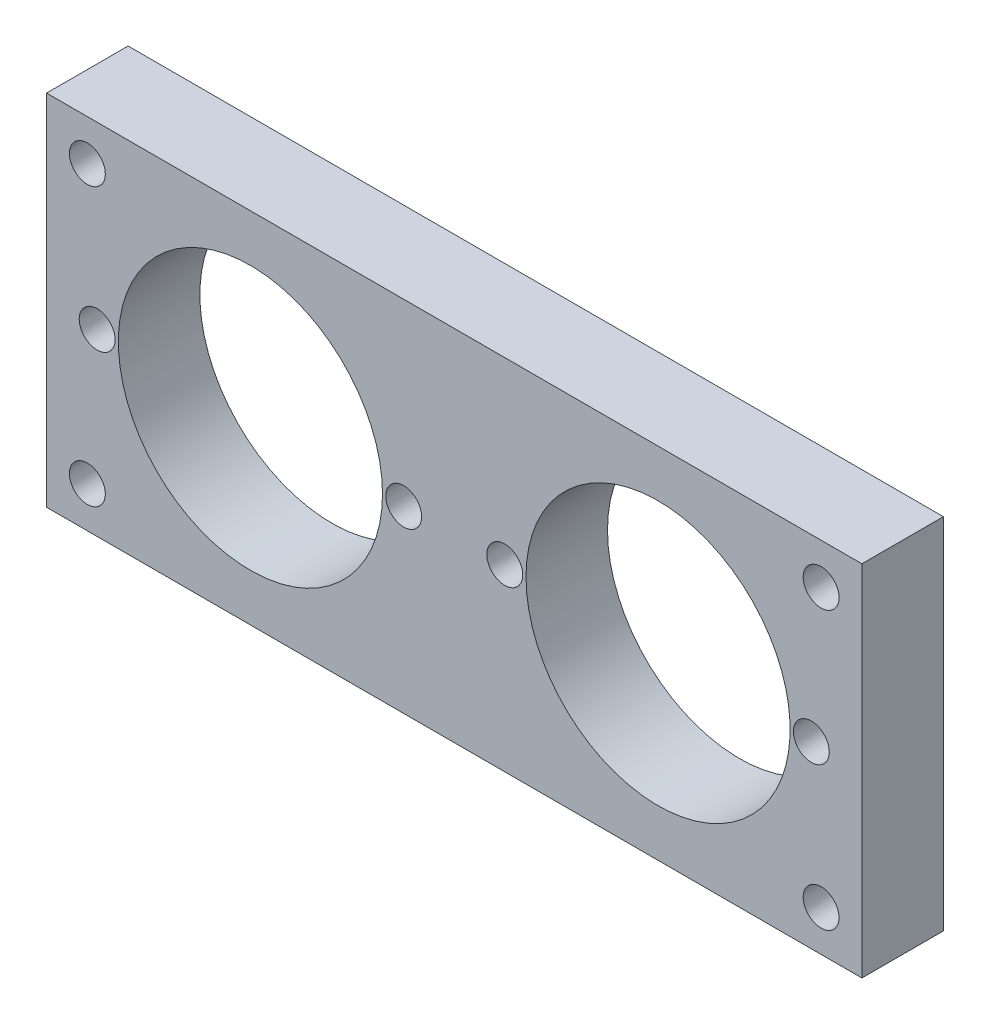
ISO-10303-21;
HEADER;
FILE_DESCRIPTION(('STEP AP214'),'2;1');
FILE_NAME('part.step','',(''),(''),'','','');
FILE_SCHEMA(('AUTOMOTIVE_DESIGN { 1 0 10303 214 1 1 1 1 }'));
ENDSEC;
DATA;
#1=APPLICATION_CONTEXT('core data for automotive mechanical design processes');
#2=APPLICATION_PROTOCOL_DEFINITION('international standard','automotive_design',2000,#1);
#3=PRODUCT_CONTEXT('',#1,'mechanical');
#4=PRODUCT('Part','Part','',(#3));
#5=PRODUCT_RELATED_PRODUCT_CATEGORY('part','',(#4));
#6=PRODUCT_DEFINITION_FORMATION('','',#4);
#7=PRODUCT_DEFINITION_CONTEXT('part definition',#1,'design');
#8=PRODUCT_DEFINITION('design','',#6,#7);
#9=PRODUCT_DEFINITION_SHAPE('','',#8);
#10=(LENGTH_UNIT() NAMED_UNIT(*) SI_UNIT(.MILLI.,.METRE.));
#11=(NAMED_UNIT(*) PLANE_ANGLE_UNIT() SI_UNIT($,.RADIAN.));
#12=(NAMED_UNIT(*) SI_UNIT($,.STERADIAN.) SOLID_ANGLE_UNIT());
#13=UNCERTAINTY_MEASURE_WITH_UNIT(LENGTH_MEASURE(1.E-05),#10,'distance_accuracy_value','');
#14=(GEOMETRIC_REPRESENTATION_CONTEXT(3) GLOBAL_UNCERTAINTY_ASSIGNED_CONTEXT((#13)) GLOBAL_UNIT_ASSIGNED_CONTEXT((#10,
#11,#12)) REPRESENTATION_CONTEXT('',''));
#15=CARTESIAN_POINT('',(0.,0.,0.));
#16=DIRECTION('',(0.,0.,1.));
#17=DIRECTION('',(1.,0.,0.));
#18=AXIS2_PLACEMENT_3D('',#15,#16,#17);
#19=CARTESIAN_POINT('',(0.,0.,5.));
#20=DIRECTION('',(0.,0.,1.));
#21=DIRECTION('',(1.,0.,0.));
#22=AXIS2_PLACEMENT_3D('',#19,#20,#21);
#23=PLANE('',#22);
#24=CARTESIAN_POINT('',(3.1,0.,5.));
#25=DIRECTION('',(0.,0.,1.));
#26=DIRECTION('',(-1.,0.,0.));
#27=AXIS2_PLACEMENT_3D('',#24,#25,#26);
#28=CIRCLE('',#27,1.1);
#29=CARTESIAN_POINT('',(2.,0.,5.));
#30=VERTEX_POINT('',#29);
#31=EDGE_CURVE('E163',#30,#30,#28,.T.);
#32=ORIENTED_EDGE('',*,*,#31,.F.);
#33=EDGE_LOOP('',(#32));
#34=FACE_BOUND('',#33,.T.);
#35=CARTESIAN_POINT('',(21.9,0.,5.));
#36=DIRECTION('',(0.,0.,1.));
#37=DIRECTION('',(1.,0.,0.));
#38=AXIS2_PLACEMENT_3D('',#35,#36,#37);
#39=CIRCLE('',#38,1.1);
#40=CARTESIAN_POINT('',(23.,0.,5.));
#41=VERTEX_POINT('',#40);
#42=EDGE_CURVE('E151',#41,#41,#39,.T.);
#43=ORIENTED_EDGE('',*,*,#42,.F.);
#44=EDGE_LOOP('',(#43));
#45=FACE_BOUND('',#44,.T.);
#46=CARTESIAN_POINT('',(-12.5,0.,5.));
#47=DIRECTION('',(0.,0.,1.));
#48=DIRECTION('',(1.,0.,0.));
#49=AXIS2_PLACEMENT_3D('',#46,#47,#48);
#50=CIRCLE('',#49,8.1);
#51=CARTESIAN_POINT('',(-4.4,0.,5.));
#52=VERTEX_POINT('',#51);
#53=EDGE_CURVE('E139',#52,#52,#50,.T.);
#54=ORIENTED_EDGE('',*,*,#53,.F.);
#55=EDGE_LOOP('',(#54));
#56=FACE_BOUND('',#55,.T.);
#57=CARTESIAN_POINT('',(22.5,-8.5,5.));
#58=DIRECTION('',(0.,0.,1.));
#59=DIRECTION('',(1.,0.,0.));
#60=AXIS2_PLACEMENT_3D('',#57,#58,#59);
#61=CIRCLE('',#60,1.1);
#62=CARTESIAN_POINT('',(23.6,-8.5,5.));
#63=VERTEX_POINT('',#62);
#64=EDGE_CURVE('E127',#63,#63,#61,.T.);
#65=ORIENTED_EDGE('',*,*,#64,.F.);
#66=EDGE_LOOP('',(#65));
#67=FACE_BOUND('',#66,.T.);
#68=CARTESIAN_POINT('',(-22.5,8.5,5.));
#69=DIRECTION('',(0.,0.,1.));
#70=DIRECTION('',(1.,0.,0.));
#71=AXIS2_PLACEMENT_3D('',#68,#69,#70);
#72=CIRCLE('',#71,1.1);
#73=CARTESIAN_POINT('',(-21.4,8.5,5.));
#74=VERTEX_POINT('',#73);
#75=EDGE_CURVE('E106',#74,#74,#72,.T.);
#76=ORIENTED_EDGE('',*,*,#75,.F.);
#77=EDGE_LOOP('',(#76));
#78=FACE_BOUND('',#77,.T.);
#79=DIRECTION('',(0.,1.,0.));
#80=VECTOR('',#79,1.);
#81=CARTESIAN_POINT('',(25.,11.,5.));
#82=LINE('',#81,#80);
#83=CARTESIAN_POINT('',(25.,-11.,5.));
#84=VERTEX_POINT('',#83);
#85=CARTESIAN_POINT('',(25.,11.,5.));
#86=VERTEX_POINT('',#85);
#87=EDGE_CURVE('E91',#84,#86,#82,.T.);
#88=ORIENTED_EDGE('',*,*,#87,.T.);
#89=DIRECTION('',(-1.,0.,0.));
#90=VECTOR('',#89,1.);
#91=CARTESIAN_POINT('',(-25.,11.,5.));
#92=LINE('',#91,#90);
#93=CARTESIAN_POINT('',(-25.,11.,5.));
#94=VERTEX_POINT('',#93);
#95=EDGE_CURVE('E86',#86,#94,#92,.T.);
#96=ORIENTED_EDGE('',*,*,#95,.T.);
#97=DIRECTION('',(0.,-1.,0.));
#98=VECTOR('',#97,1.);
#99=CARTESIAN_POINT('',(-25.,11.,5.));
#100=LINE('',#99,#98);
#101=CARTESIAN_POINT('',(-25.,-11.,5.));
#102=VERTEX_POINT('',#101);
#103=EDGE_CURVE('E89',#94,#102,#100,.T.);
#104=ORIENTED_EDGE('',*,*,#103,.T.);
#105=DIRECTION('',(1.,0.,0.));
#106=VECTOR('',#105,1.);
#107=CARTESIAN_POINT('',(-25.,-11.,5.));
#108=LINE('',#107,#106);
#109=EDGE_CURVE('E56',#102,#84,#108,.T.);
#110=ORIENTED_EDGE('',*,*,#109,.T.);
#111=EDGE_LOOP('',(#88,#96,#104,#110));
#112=FACE_BOUND('',#111,.T.);
#113=CARTESIAN_POINT('',(22.5,8.5,5.));
#114=DIRECTION('',(0.,0.,1.));
#115=DIRECTION('',(-1.,0.,0.));
#116=AXIS2_PLACEMENT_3D('',#113,#114,#115);
#117=CIRCLE('',#116,1.1);
#118=CARTESIAN_POINT('',(21.4,8.5,5.));
#119=VERTEX_POINT('',#118);
#120=EDGE_CURVE('E121',#119,#119,#117,.T.);
#121=ORIENTED_EDGE('',*,*,#120,.F.);
#122=EDGE_LOOP('',(#121));
#123=FACE_BOUND('',#122,.T.);
#124=CARTESIAN_POINT('',(-22.5,-8.5,5.));
#125=DIRECTION('',(0.,0.,1.));
#126=DIRECTION('',(-1.,0.,0.));
#127=AXIS2_PLACEMENT_3D('',#124,#125,#126);
#128=CIRCLE('',#127,1.1);
#129=CARTESIAN_POINT('',(-23.6,-8.5,5.));
#130=VERTEX_POINT('',#129);
#131=EDGE_CURVE('E133',#130,#130,#128,.T.);
#132=ORIENTED_EDGE('',*,*,#131,.F.);
#133=EDGE_LOOP('',(#132));
#134=FACE_BOUND('',#133,.T.);
#135=CARTESIAN_POINT('',(12.5,0.,5.));
#136=DIRECTION('',(0.,0.,1.));
#137=DIRECTION('',(-1.,0.,0.));
#138=AXIS2_PLACEMENT_3D('',#135,#136,#137);
#139=CIRCLE('',#138,8.1);
#140=CARTESIAN_POINT('',(4.4,0.,5.));
#141=VERTEX_POINT('',#140);
#142=EDGE_CURVE('E145',#141,#141,#139,.T.);
#143=ORIENTED_EDGE('',*,*,#142,.F.);
#144=EDGE_LOOP('',(#143));
#145=FACE_BOUND('',#144,.T.);
#146=CARTESIAN_POINT('',(-21.9,0.,5.));
#147=DIRECTION('',(0.,0.,1.));
#148=DIRECTION('',(-1.,0.,0.));
#149=AXIS2_PLACEMENT_3D('',#146,#147,#148);
#150=CIRCLE('',#149,1.1);
#151=CARTESIAN_POINT('',(-23.,0.,5.));
#152=VERTEX_POINT('',#151);
#153=EDGE_CURVE('E157',#152,#152,#150,.T.);
#154=ORIENTED_EDGE('',*,*,#153,.F.);
#155=EDGE_LOOP('',(#154));
#156=FACE_BOUND('',#155,.T.);
#157=CARTESIAN_POINT('',(-3.1,0.,5.));
#158=DIRECTION('',(0.,0.,1.));
#159=DIRECTION('',(1.,0.,0.));
#160=AXIS2_PLACEMENT_3D('',#157,#158,#159);
#161=CIRCLE('',#160,1.1);
#162=CARTESIAN_POINT('',(-2.,0.,5.));
#163=VERTEX_POINT('',#162);
#164=EDGE_CURVE('E169',#163,#163,#161,.T.);
#165=ORIENTED_EDGE('',*,*,#164,.F.);
#166=EDGE_LOOP('',(#165));
#167=FACE_BOUND('',#166,.T.);
#168=ADVANCED_FACE('F39',(#34,#45,#56,#67,#78,#112,#123,#134,#145,#156,#167),#23,.T.);
#169=CARTESIAN_POINT('',(0.,0.,0.));
#170=DIRECTION('',(0.,0.,1.));
#171=DIRECTION('',(1.,0.,0.));
#172=AXIS2_PLACEMENT_3D('',#169,#170,#171);
#173=PLANE('',#172);
#174=DIRECTION('',(0.,1.,0.));
#175=VECTOR('',#174,1.);
#176=CARTESIAN_POINT('',(25.,11.,0.));
#177=LINE('',#176,#175);
#178=CARTESIAN_POINT('',(25.,-11.,0.));
#179=VERTEX_POINT('',#178);
#180=CARTESIAN_POINT('',(25.,11.,0.));
#181=VERTEX_POINT('',#180);
#182=EDGE_CURVE('E103',#179,#181,#177,.T.);
#183=ORIENTED_EDGE('',*,*,#182,.F.);
#184=DIRECTION('',(1.,0.,0.));
#185=VECTOR('',#184,1.);
#186=CARTESIAN_POINT('',(-25.,-11.,0.));
#187=LINE('',#186,#185);
#188=CARTESIAN_POINT('',(-25.,-11.,0.));
#189=VERTEX_POINT('',#188);
#190=EDGE_CURVE('E79',#189,#179,#187,.T.);
#191=ORIENTED_EDGE('',*,*,#190,.F.);
#192=DIRECTION('',(0.,-1.,0.));
#193=VECTOR('',#192,1.);
#194=CARTESIAN_POINT('',(-25.,11.,0.));
#195=LINE('',#194,#193);
#196=CARTESIAN_POINT('',(-25.,11.,0.));
#197=VERTEX_POINT('',#196);
#198=EDGE_CURVE('E73',#197,#189,#195,.T.);
#199=ORIENTED_EDGE('',*,*,#198,.F.);
#200=DIRECTION('',(-1.,0.,0.));
#201=VECTOR('',#200,1.);
#202=CARTESIAN_POINT('',(-25.,11.,0.));
#203=LINE('',#202,#201);
#204=EDGE_CURVE('E95',#181,#197,#203,.T.);
#205=ORIENTED_EDGE('',*,*,#204,.F.);
#206=EDGE_LOOP('',(#183,#191,#199,#205));
#207=FACE_BOUND('',#206,.T.);
#208=CARTESIAN_POINT('',(-22.5,8.5,0.));
#209=DIRECTION('',(0.,0.,1.));
#210=DIRECTION('',(1.,0.,0.));
#211=AXIS2_PLACEMENT_3D('',#208,#209,#210);
#212=CIRCLE('',#211,1.1);
#213=CARTESIAN_POINT('',(-21.4,8.5,0.));
#214=VERTEX_POINT('',#213);
#215=EDGE_CURVE('E118',#214,#214,#212,.T.);
#216=ORIENTED_EDGE('',*,*,#215,.T.);
#217=EDGE_LOOP('',(#216));
#218=FACE_BOUND('',#217,.T.);
#219=CARTESIAN_POINT('',(22.5,8.5,0.));
#220=DIRECTION('',(0.,0.,1.));
#221=DIRECTION('',(-1.,0.,0.));
#222=AXIS2_PLACEMENT_3D('',#219,#220,#221);
#223=CIRCLE('',#222,1.1);
#224=CARTESIAN_POINT('',(21.4,8.5,0.));
#225=VERTEX_POINT('',#224);
#226=EDGE_CURVE('E124',#225,#225,#223,.T.);
#227=ORIENTED_EDGE('',*,*,#226,.T.);
#228=EDGE_LOOP('',(#227));
#229=FACE_BOUND('',#228,.T.);
#230=CARTESIAN_POINT('',(22.5,-8.5,0.));
#231=DIRECTION('',(0.,0.,1.));
#232=DIRECTION('',(1.,0.,0.));
#233=AXIS2_PLACEMENT_3D('',#230,#231,#232);
#234=CIRCLE('',#233,1.1);
#235=CARTESIAN_POINT('',(23.6,-8.5,0.));
#236=VERTEX_POINT('',#235);
#237=EDGE_CURVE('E130',#236,#236,#234,.T.);
#238=ORIENTED_EDGE('',*,*,#237,.T.);
#239=EDGE_LOOP('',(#238));
#240=FACE_BOUND('',#239,.T.);
#241=CARTESIAN_POINT('',(-22.5,-8.5,0.));
#242=DIRECTION('',(0.,0.,1.));
#243=DIRECTION('',(-1.,0.,0.));
#244=AXIS2_PLACEMENT_3D('',#241,#242,#243);
#245=CIRCLE('',#244,1.1);
#246=CARTESIAN_POINT('',(-23.6,-8.5,0.));
#247=VERTEX_POINT('',#246);
#248=EDGE_CURVE('E136',#247,#247,#245,.T.);
#249=ORIENTED_EDGE('',*,*,#248,.T.);
#250=EDGE_LOOP('',(#249));
#251=FACE_BOUND('',#250,.T.);
#252=CARTESIAN_POINT('',(-12.5,0.,0.));
#253=DIRECTION('',(0.,0.,1.));
#254=DIRECTION('',(1.,0.,0.));
#255=AXIS2_PLACEMENT_3D('',#252,#253,#254);
#256=CIRCLE('',#255,8.1);
#257=CARTESIAN_POINT('',(-4.4,0.,0.));
#258=VERTEX_POINT('',#257);
#259=EDGE_CURVE('E142',#258,#258,#256,.T.);
#260=ORIENTED_EDGE('',*,*,#259,.T.);
#261=EDGE_LOOP('',(#260));
#262=FACE_BOUND('',#261,.T.);
#263=CARTESIAN_POINT('',(12.5,0.,0.));
#264=DIRECTION('',(0.,0.,1.));
#265=DIRECTION('',(-1.,0.,0.));
#266=AXIS2_PLACEMENT_3D('',#263,#264,#265);
#267=CIRCLE('',#266,8.1);
#268=CARTESIAN_POINT('',(4.4,0.,0.));
#269=VERTEX_POINT('',#268);
#270=EDGE_CURVE('E148',#269,#269,#267,.T.);
#271=ORIENTED_EDGE('',*,*,#270,.T.);
#272=EDGE_LOOP('',(#271));
#273=FACE_BOUND('',#272,.T.);
#274=CARTESIAN_POINT('',(21.9,0.,0.));
#275=DIRECTION('',(0.,0.,1.));
#276=DIRECTION('',(1.,0.,0.));
#277=AXIS2_PLACEMENT_3D('',#274,#275,#276);
#278=CIRCLE('',#277,1.1);
#279=CARTESIAN_POINT('',(23.,0.,0.));
#280=VERTEX_POINT('',#279);
#281=EDGE_CURVE('E154',#280,#280,#278,.T.);
#282=ORIENTED_EDGE('',*,*,#281,.T.);
#283=EDGE_LOOP('',(#282));
#284=FACE_BOUND('',#283,.T.);
#285=CARTESIAN_POINT('',(-21.9,0.,0.));
#286=DIRECTION('',(0.,0.,1.));
#287=DIRECTION('',(-1.,0.,0.));
#288=AXIS2_PLACEMENT_3D('',#285,#286,#287);
#289=CIRCLE('',#288,1.1);
#290=CARTESIAN_POINT('',(-23.,0.,0.));
#291=VERTEX_POINT('',#290);
#292=EDGE_CURVE('E160',#291,#291,#289,.T.);
#293=ORIENTED_EDGE('',*,*,#292,.T.);
#294=EDGE_LOOP('',(#293));
#295=FACE_BOUND('',#294,.T.);
#296=CARTESIAN_POINT('',(3.1,0.,0.));
#297=DIRECTION('',(0.,0.,1.));
#298=DIRECTION('',(-1.,0.,0.));
#299=AXIS2_PLACEMENT_3D('',#296,#297,#298);
#300=CIRCLE('',#299,1.1);
#301=CARTESIAN_POINT('',(2.,0.,0.));
#302=VERTEX_POINT('',#301);
#303=EDGE_CURVE('E166',#302,#302,#300,.T.);
#304=ORIENTED_EDGE('',*,*,#303,.T.);
#305=EDGE_LOOP('',(#304));
#306=FACE_BOUND('',#305,.T.);
#307=CARTESIAN_POINT('',(-3.1,0.,0.));
#308=DIRECTION('',(0.,0.,1.));
#309=DIRECTION('',(1.,0.,0.));
#310=AXIS2_PLACEMENT_3D('',#307,#308,#309);
#311=CIRCLE('',#310,1.1);
#312=CARTESIAN_POINT('',(-2.,0.,0.));
#313=VERTEX_POINT('',#312);
#314=EDGE_CURVE('E172',#313,#313,#311,.T.);
#315=ORIENTED_EDGE('',*,*,#314,.T.);
#316=EDGE_LOOP('',(#315));
#317=FACE_BOUND('',#316,.T.);
#318=ADVANCED_FACE('F114',(#207,#218,#229,#240,#251,#262,#273,#284,#295,#306,#317),#173,.F.);
#319=CARTESIAN_POINT('',(25.,11.,5.));
#320=DIRECTION('',(-1.,0.,0.));
#321=DIRECTION('',(0.,0.,1.));
#322=AXIS2_PLACEMENT_3D('',#319,#320,#321);
#323=PLANE('',#322);
#324=ORIENTED_EDGE('',*,*,#182,.T.);
#325=DIRECTION('',(0.,0.,-1.));
#326=VECTOR('',#325,1.);
#327=CARTESIAN_POINT('',(25.,11.,5.));
#328=LINE('',#327,#326);
#329=EDGE_CURVE('E11',#86,#181,#328,.T.);
#330=ORIENTED_EDGE('',*,*,#329,.F.);
#331=ORIENTED_EDGE('',*,*,#87,.F.);
#332=DIRECTION('',(0.,0.,-1.));
#333=VECTOR('',#332,1.);
#334=CARTESIAN_POINT('',(25.,-11.,5.));
#335=LINE('',#334,#333);
#336=EDGE_CURVE('E99',#84,#179,#335,.T.);
#337=ORIENTED_EDGE('',*,*,#336,.T.);
#338=EDGE_LOOP('',(#324,#330,#331,#337));
#339=FACE_BOUND('',#338,.T.);
#340=ADVANCED_FACE('F41',(#339),#323,.F.);
#341=CARTESIAN_POINT('',(-25.,11.,5.));
#342=DIRECTION('',(0.,-1.,0.));
#343=DIRECTION('',(0.,0.,-1.));
#344=AXIS2_PLACEMENT_3D('',#341,#342,#343);
#345=PLANE('',#344);
#346=ORIENTED_EDGE('',*,*,#204,.T.);
#347=DIRECTION('',(0.,0.,-1.));
#348=VECTOR('',#347,1.);
#349=CARTESIAN_POINT('',(-25.,11.,5.));
#350=LINE('',#349,#348);
#351=EDGE_CURVE('E48',#94,#197,#350,.T.);
#352=ORIENTED_EDGE('',*,*,#351,.F.);
#353=ORIENTED_EDGE('',*,*,#95,.F.);
#354=ORIENTED_EDGE('',*,*,#329,.T.);
#355=EDGE_LOOP('',(#346,#352,#353,#354));
#356=FACE_BOUND('',#355,.T.);
#357=ADVANCED_FACE('F94',(#356),#345,.F.);
#358=CARTESIAN_POINT('',(-25.,11.,5.));
#359=DIRECTION('',(1.,0.,0.));
#360=DIRECTION('',(0.,0.,-1.));
#361=AXIS2_PLACEMENT_3D('',#358,#359,#360);
#362=PLANE('',#361);
#363=ORIENTED_EDGE('',*,*,#198,.T.);
#364=DIRECTION('',(0.,0.,-1.));
#365=VECTOR('',#364,1.);
#366=CARTESIAN_POINT('',(-25.,-11.,5.));
#367=LINE('',#366,#365);
#368=EDGE_CURVE('E96',#102,#189,#367,.T.);
#369=ORIENTED_EDGE('',*,*,#368,.F.);
#370=ORIENTED_EDGE('',*,*,#103,.F.);
#371=ORIENTED_EDGE('',*,*,#351,.T.);
#372=EDGE_LOOP('',(#363,#369,#370,#371));
#373=FACE_BOUND('',#372,.T.);
#374=ADVANCED_FACE('F97',(#373),#362,.F.);
#375=CARTESIAN_POINT('',(-25.,-11.,5.));
#376=DIRECTION('',(0.,1.,0.));
#377=DIRECTION('',(0.,0.,1.));
#378=AXIS2_PLACEMENT_3D('',#375,#376,#377);
#379=PLANE('',#378);
#380=ORIENTED_EDGE('',*,*,#190,.T.);
#381=ORIENTED_EDGE('',*,*,#336,.F.);
#382=ORIENTED_EDGE('',*,*,#109,.F.);
#383=ORIENTED_EDGE('',*,*,#368,.T.);
#384=EDGE_LOOP('',(#380,#381,#382,#383));
#385=FACE_BOUND('',#384,.T.);
#386=ADVANCED_FACE('F111',(#385),#379,.F.);
#387=CARTESIAN_POINT('',(-22.5,8.5,5.));
#388=DIRECTION('',(0.,0.,-1.));
#389=DIRECTION('',(-1.,0.,0.));
#390=AXIS2_PLACEMENT_3D('',#387,#388,#389);
#391=CYLINDRICAL_SURFACE('',#390,1.1);
#392=ORIENTED_EDGE('',*,*,#75,.T.);
#393=EDGE_LOOP('',(#392));
#394=FACE_BOUND('',#393,.T.);
#395=ORIENTED_EDGE('',*,*,#215,.F.);
#396=EDGE_LOOP('',(#395));
#397=FACE_BOUND('',#396,.T.);
#398=ADVANCED_FACE('F191',(#394,#397),#391,.F.);
#399=CARTESIAN_POINT('',(22.5,8.5,5.));
#400=DIRECTION('',(0.,0.,-1.));
#401=DIRECTION('',(-1.,0.,0.));
#402=AXIS2_PLACEMENT_3D('',#399,#400,#401);
#403=CYLINDRICAL_SURFACE('',#402,1.1);
#404=ORIENTED_EDGE('',*,*,#120,.T.);
#405=EDGE_LOOP('',(#404));
#406=FACE_BOUND('',#405,.T.);
#407=ORIENTED_EDGE('',*,*,#226,.F.);
#408=EDGE_LOOP('',(#407));
#409=FACE_BOUND('',#408,.T.);
#410=ADVANCED_FACE('F245',(#406,#409),#403,.F.);
#411=CARTESIAN_POINT('',(22.5,-8.5,5.));
#412=DIRECTION('',(0.,0.,-1.));
#413=DIRECTION('',(-1.,0.,0.));
#414=AXIS2_PLACEMENT_3D('',#411,#412,#413);
#415=CYLINDRICAL_SURFACE('',#414,1.1);
#416=ORIENTED_EDGE('',*,*,#64,.T.);
#417=EDGE_LOOP('',(#416));
#418=FACE_BOUND('',#417,.T.);
#419=ORIENTED_EDGE('',*,*,#237,.F.);
#420=EDGE_LOOP('',(#419));
#421=FACE_BOUND('',#420,.T.);
#422=ADVANCED_FACE('F254',(#418,#421),#415,.F.);
#423=CARTESIAN_POINT('',(-22.5,-8.5,5.));
#424=DIRECTION('',(0.,0.,-1.));
#425=DIRECTION('',(-1.,0.,0.));
#426=AXIS2_PLACEMENT_3D('',#423,#424,#425);
#427=CYLINDRICAL_SURFACE('',#426,1.1);
#428=ORIENTED_EDGE('',*,*,#131,.T.);
#429=EDGE_LOOP('',(#428));
#430=FACE_BOUND('',#429,.T.);
#431=ORIENTED_EDGE('',*,*,#248,.F.);
#432=EDGE_LOOP('',(#431));
#433=FACE_BOUND('',#432,.T.);
#434=ADVANCED_FACE('F263',(#430,#433),#427,.F.);
#435=CARTESIAN_POINT('',(-12.5,0.,5.));
#436=DIRECTION('',(0.,0.,-1.));
#437=DIRECTION('',(-1.,0.,0.));
#438=AXIS2_PLACEMENT_3D('',#435,#436,#437);
#439=CYLINDRICAL_SURFACE('',#438,8.1);
#440=ORIENTED_EDGE('',*,*,#53,.T.);
#441=EDGE_LOOP('',(#440));
#442=FACE_BOUND('',#441,.T.);
#443=ORIENTED_EDGE('',*,*,#259,.F.);
#444=EDGE_LOOP('',(#443));
#445=FACE_BOUND('',#444,.T.);
#446=ADVANCED_FACE('F273',(#442,#445),#439,.F.);
#447=CARTESIAN_POINT('',(12.5,0.,5.));
#448=DIRECTION('',(0.,0.,-1.));
#449=DIRECTION('',(-1.,0.,0.));
#450=AXIS2_PLACEMENT_3D('',#447,#448,#449);
#451=CYLINDRICAL_SURFACE('',#450,8.1);
#452=ORIENTED_EDGE('',*,*,#142,.T.);
#453=EDGE_LOOP('',(#452));
#454=FACE_BOUND('',#453,.T.);
#455=ORIENTED_EDGE('',*,*,#270,.F.);
#456=EDGE_LOOP('',(#455));
#457=FACE_BOUND('',#456,.T.);
#458=ADVANCED_FACE('F283',(#454,#457),#451,.F.);
#459=CARTESIAN_POINT('',(21.9,0.,5.));
#460=DIRECTION('',(0.,0.,-1.));
#461=DIRECTION('',(-1.,0.,0.));
#462=AXIS2_PLACEMENT_3D('',#459,#460,#461);
#463=CYLINDRICAL_SURFACE('',#462,1.1);
#464=ORIENTED_EDGE('',*,*,#42,.T.);
#465=EDGE_LOOP('',(#464));
#466=FACE_BOUND('',#465,.T.);
#467=ORIENTED_EDGE('',*,*,#281,.F.);
#468=EDGE_LOOP('',(#467));
#469=FACE_BOUND('',#468,.T.);
#470=ADVANCED_FACE('F293',(#466,#469),#463,.F.);
#471=CARTESIAN_POINT('',(-21.9,0.,5.));
#472=DIRECTION('',(0.,0.,-1.));
#473=DIRECTION('',(-1.,0.,0.));
#474=AXIS2_PLACEMENT_3D('',#471,#472,#473);
#475=CYLINDRICAL_SURFACE('',#474,1.1);
#476=ORIENTED_EDGE('',*,*,#153,.T.);
#477=EDGE_LOOP('',(#476));
#478=FACE_BOUND('',#477,.T.);
#479=ORIENTED_EDGE('',*,*,#292,.F.);
#480=EDGE_LOOP('',(#479));
#481=FACE_BOUND('',#480,.T.);
#482=ADVANCED_FACE('F303',(#478,#481),#475,.F.);
#483=CARTESIAN_POINT('',(3.1,0.,5.));
#484=DIRECTION('',(0.,0.,-1.));
#485=DIRECTION('',(-1.,0.,0.));
#486=AXIS2_PLACEMENT_3D('',#483,#484,#485);
#487=CYLINDRICAL_SURFACE('',#486,1.1);
#488=ORIENTED_EDGE('',*,*,#31,.T.);
#489=EDGE_LOOP('',(#488));
#490=FACE_BOUND('',#489,.T.);
#491=ORIENTED_EDGE('',*,*,#303,.F.);
#492=EDGE_LOOP('',(#491));
#493=FACE_BOUND('',#492,.T.);
#494=ADVANCED_FACE('F313',(#490,#493),#487,.F.);
#495=CARTESIAN_POINT('',(-3.1,0.,5.));
#496=DIRECTION('',(0.,0.,-1.));
#497=DIRECTION('',(-1.,0.,0.));
#498=AXIS2_PLACEMENT_3D('',#495,#496,#497);
#499=CYLINDRICAL_SURFACE('',#498,1.1);
#500=ORIENTED_EDGE('',*,*,#164,.T.);
#501=EDGE_LOOP('',(#500));
#502=FACE_BOUND('',#501,.T.);
#503=ORIENTED_EDGE('',*,*,#314,.F.);
#504=EDGE_LOOP('',(#503));
#505=FACE_BOUND('',#504,.T.);
#506=ADVANCED_FACE('F178',(#502,#505),#499,.F.);
#507=CLOSED_SHELL('',(#168,#318,#340,#357,#374,#386,#398,#410,#422,#434,#446,#458,#470,#482,
#494,#506));
#508=MANIFOLD_SOLID_BREP('B2',#507);
#509=ADVANCED_BREP_SHAPE_REPRESENTATION('',(#18,#508),#14);
#510=SHAPE_DEFINITION_REPRESENTATION(#9,#509);
ENDSEC;
END-ISO-10303-21;
